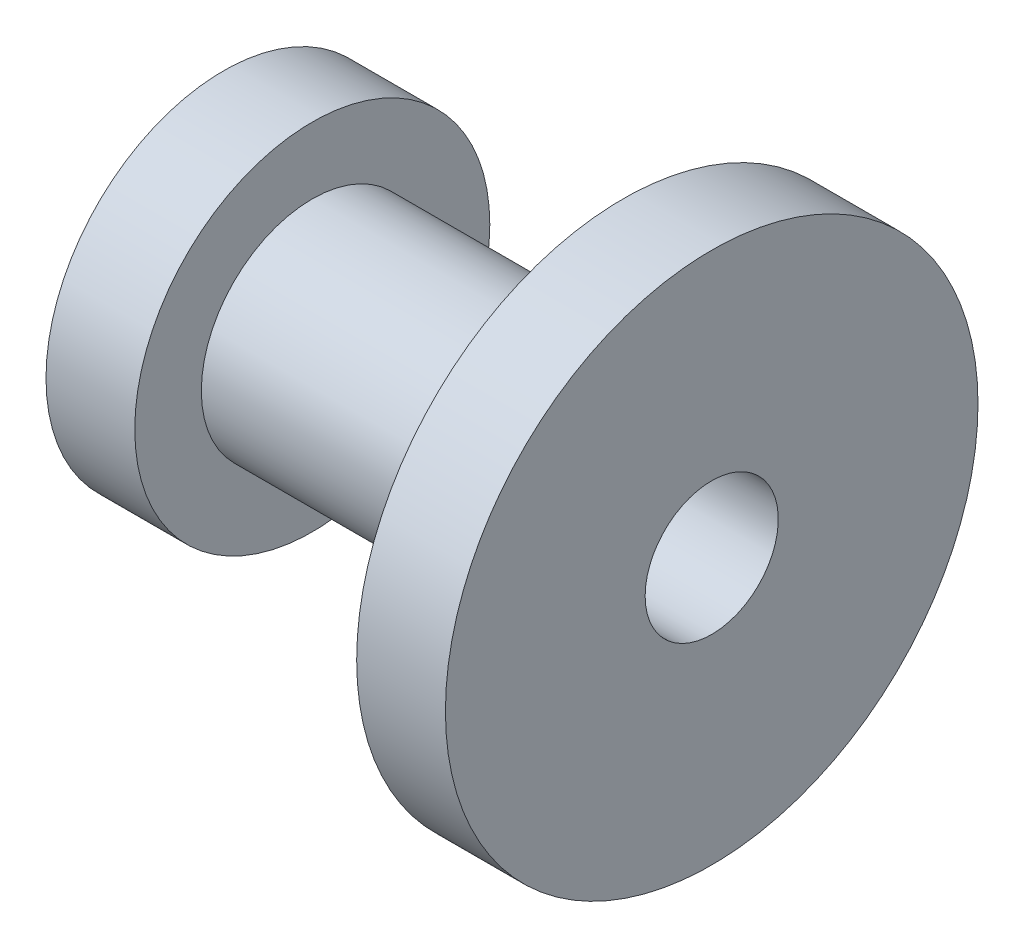
ISO-10303-21;
HEADER;
FILE_DESCRIPTION(('STEP AP214'),'2;1');
FILE_NAME('part.step','',(''),(''),'','','');
FILE_SCHEMA(('AUTOMOTIVE_DESIGN { 1 0 10303 214 1 1 1 1 }'));
ENDSEC;
DATA;
#1=APPLICATION_CONTEXT('core data for automotive mechanical design processes');
#2=APPLICATION_PROTOCOL_DEFINITION('international standard','automotive_design',2000,#1);
#3=PRODUCT_CONTEXT('',#1,'mechanical');
#4=PRODUCT('Part','Part','',(#3));
#5=PRODUCT_RELATED_PRODUCT_CATEGORY('part','',(#4));
#6=PRODUCT_DEFINITION_FORMATION('','',#4);
#7=PRODUCT_DEFINITION_CONTEXT('part definition',#1,'design');
#8=PRODUCT_DEFINITION('design','',#6,#7);
#9=PRODUCT_DEFINITION_SHAPE('','',#8);
#10=(LENGTH_UNIT() NAMED_UNIT(*) SI_UNIT(.MILLI.,.METRE.));
#11=(NAMED_UNIT(*) PLANE_ANGLE_UNIT() SI_UNIT($,.RADIAN.));
#12=(NAMED_UNIT(*) SI_UNIT($,.STERADIAN.) SOLID_ANGLE_UNIT());
#13=UNCERTAINTY_MEASURE_WITH_UNIT(LENGTH_MEASURE(1.E-05),#10,'distance_accuracy_value','');
#14=(GEOMETRIC_REPRESENTATION_CONTEXT(3) GLOBAL_UNCERTAINTY_ASSIGNED_CONTEXT((#13)) GLOBAL_UNIT_ASSIGNED_CONTEXT((#10,
#11,#12)) REPRESENTATION_CONTEXT('',''));
#15=CARTESIAN_POINT('',(0.,0.,0.));
#16=DIRECTION('',(0.,0.,1.));
#17=DIRECTION('',(1.,0.,0.));
#18=AXIS2_PLACEMENT_3D('',#15,#16,#17);
#19=CARTESIAN_POINT('',(0.,0.,0.));
#20=DIRECTION('',(1.,0.,0.));
#21=DIRECTION('',(0.,0.,-1.));
#22=AXIS2_PLACEMENT_3D('',#19,#20,#21);
#23=PLANE('',#22);
#24=CARTESIAN_POINT('',(0.,0.,0.));
#25=DIRECTION('',(-1.,0.,0.));
#26=DIRECTION('',(0.,0.,1.));
#27=AXIS2_PLACEMENT_3D('',#24,#25,#26);
#28=CIRCLE('',#27,15.);
#29=CARTESIAN_POINT('',(0.,0.,15.));
#30=VERTEX_POINT('',#29);
#31=EDGE_CURVE('E56',#30,#30,#28,.T.);
#32=ORIENTED_EDGE('',*,*,#31,.F.);
#33=EDGE_LOOP('',(#32));
#34=FACE_BOUND('',#33,.T.);
#35=CARTESIAN_POINT('',(0.,0.,0.));
#36=DIRECTION('',(-1.,0.,0.));
#37=DIRECTION('',(0.,0.,1.));
#38=AXIS2_PLACEMENT_3D('',#35,#36,#37);
#39=CIRCLE('',#38,40.);
#40=CARTESIAN_POINT('',(0.,0.,40.));
#41=VERTEX_POINT('',#40);
#42=EDGE_CURVE('E10',#41,#41,#39,.T.);
#43=ORIENTED_EDGE('',*,*,#42,.T.);
#44=EDGE_LOOP('',(#43));
#45=FACE_BOUND('',#44,.T.);
#46=ADVANCED_FACE('F31',(#34,#45),#23,.F.);
#47=CARTESIAN_POINT('',(0.,0.,0.));
#48=DIRECTION('',(-1.,0.,0.));
#49=DIRECTION('',(0.,0.,1.));
#50=AXIS2_PLACEMENT_3D('',#47,#48,#49);
#51=CYLINDRICAL_SURFACE('',#50,40.);
#52=ORIENTED_EDGE('',*,*,#42,.F.);
#53=EDGE_LOOP('',(#52));
#54=FACE_BOUND('',#53,.T.);
#55=CARTESIAN_POINT('',(20.,0.,0.));
#56=DIRECTION('',(-1.,0.,0.));
#57=DIRECTION('',(0.,0.,1.));
#58=AXIS2_PLACEMENT_3D('',#55,#56,#57);
#59=CIRCLE('',#58,40.);
#60=CARTESIAN_POINT('',(20.,0.,40.));
#61=VERTEX_POINT('',#60);
#62=EDGE_CURVE('E38',#61,#61,#59,.T.);
#63=ORIENTED_EDGE('',*,*,#62,.T.);
#64=EDGE_LOOP('',(#63));
#65=FACE_BOUND('',#64,.T.);
#66=ADVANCED_FACE('F75',(#54,#65),#51,.T.);
#67=CARTESIAN_POINT('',(20.,40.,0.));
#68=DIRECTION('',(-1.,0.,0.));
#69=DIRECTION('',(0.,0.,1.));
#70=AXIS2_PLACEMENT_3D('',#67,#68,#69);
#71=PLANE('',#70);
#72=ORIENTED_EDGE('',*,*,#62,.F.);
#73=EDGE_LOOP('',(#72));
#74=FACE_BOUND('',#73,.T.);
#75=CARTESIAN_POINT('',(20.,0.,0.));
#76=DIRECTION('',(-1.,0.,0.));
#77=DIRECTION('',(0.,0.,1.));
#78=AXIS2_PLACEMENT_3D('',#75,#76,#77);
#79=CIRCLE('',#78,25.);
#80=CARTESIAN_POINT('',(20.,0.,25.));
#81=VERTEX_POINT('',#80);
#82=EDGE_CURVE('E42',#81,#81,#79,.T.);
#83=ORIENTED_EDGE('',*,*,#82,.T.);
#84=EDGE_LOOP('',(#83));
#85=FACE_BOUND('',#84,.T.);
#86=ADVANCED_FACE('F80',(#74,#85),#71,.F.);
#87=CARTESIAN_POINT('',(0.,0.,0.));
#88=DIRECTION('',(-1.,0.,0.));
#89=DIRECTION('',(0.,0.,1.));
#90=AXIS2_PLACEMENT_3D('',#87,#88,#89);
#91=CYLINDRICAL_SURFACE('',#90,25.);
#92=ORIENTED_EDGE('',*,*,#82,.F.);
#93=EDGE_LOOP('',(#92));
#94=FACE_BOUND('',#93,.T.);
#95=CARTESIAN_POINT('',(90.,0.,0.));
#96=DIRECTION('',(-1.,0.,0.));
#97=DIRECTION('',(0.,0.,1.));
#98=AXIS2_PLACEMENT_3D('',#95,#96,#97);
#99=CIRCLE('',#98,25.);
#100=CARTESIAN_POINT('',(90.,0.,25.));
#101=VERTEX_POINT('',#100);
#102=EDGE_CURVE('E47',#101,#101,#99,.T.);
#103=ORIENTED_EDGE('',*,*,#102,.T.);
#104=EDGE_LOOP('',(#103));
#105=FACE_BOUND('',#104,.T.);
#106=ADVANCED_FACE('F85',(#94,#105),#91,.T.);
#107=CARTESIAN_POINT('',(90.,25.,0.));
#108=DIRECTION('',(1.,0.,0.));
#109=DIRECTION('',(0.,0.,-1.));
#110=AXIS2_PLACEMENT_3D('',#107,#108,#109);
#111=PLANE('',#110);
#112=ORIENTED_EDGE('',*,*,#102,.F.);
#113=EDGE_LOOP('',(#112));
#114=FACE_BOUND('',#113,.T.);
#115=CARTESIAN_POINT('',(90.,0.,0.));
#116=DIRECTION('',(-1.,0.,0.));
#117=DIRECTION('',(0.,0.,1.));
#118=AXIS2_PLACEMENT_3D('',#115,#116,#117);
#119=CIRCLE('',#118,60.);
#120=CARTESIAN_POINT('',(90.,0.,60.));
#121=VERTEX_POINT('',#120);
#122=EDGE_CURVE('E50',#121,#121,#119,.T.);
#123=ORIENTED_EDGE('',*,*,#122,.T.);
#124=EDGE_LOOP('',(#123));
#125=FACE_BOUND('',#124,.T.);
#126=ADVANCED_FACE('F92',(#114,#125),#111,.F.);
#127=CARTESIAN_POINT('',(0.,0.,0.));
#128=DIRECTION('',(-1.,0.,0.));
#129=DIRECTION('',(0.,0.,1.));
#130=AXIS2_PLACEMENT_3D('',#127,#128,#129);
#131=CYLINDRICAL_SURFACE('',#130,60.);
#132=ORIENTED_EDGE('',*,*,#122,.F.);
#133=EDGE_LOOP('',(#132));
#134=FACE_BOUND('',#133,.T.);
#135=CARTESIAN_POINT('',(110.,0.,0.));
#136=DIRECTION('',(-1.,0.,0.));
#137=DIRECTION('',(0.,0.,1.));
#138=AXIS2_PLACEMENT_3D('',#135,#136,#137);
#139=CIRCLE('',#138,60.);
#140=CARTESIAN_POINT('',(110.,0.,60.));
#141=VERTEX_POINT('',#140);
#142=EDGE_CURVE('E53',#141,#141,#139,.T.);
#143=ORIENTED_EDGE('',*,*,#142,.T.);
#144=EDGE_LOOP('',(#143));
#145=FACE_BOUND('',#144,.T.);
#146=ADVANCED_FACE('F72',(#134,#145),#131,.T.);
#147=CARTESIAN_POINT('',(110.,60.,0.));
#148=DIRECTION('',(-1.,0.,0.));
#149=DIRECTION('',(0.,0.,1.));
#150=AXIS2_PLACEMENT_3D('',#147,#148,#149);
#151=PLANE('',#150);
#152=CARTESIAN_POINT('',(110.,0.,0.));
#153=DIRECTION('',(-1.,0.,0.));
#154=DIRECTION('',(0.,0.,1.));
#155=AXIS2_PLACEMENT_3D('',#152,#153,#154);
#156=CIRCLE('',#155,15.);
#157=CARTESIAN_POINT('',(110.,0.,15.));
#158=VERTEX_POINT('',#157);
#159=EDGE_CURVE('E34',#158,#158,#156,.T.);
#160=ORIENTED_EDGE('',*,*,#159,.T.);
#161=EDGE_LOOP('',(#160));
#162=FACE_BOUND('',#161,.T.);
#163=ORIENTED_EDGE('',*,*,#142,.F.);
#164=EDGE_LOOP('',(#163));
#165=FACE_BOUND('',#164,.T.);
#166=ADVANCED_FACE('F63',(#162,#165),#151,.F.);
#167=CARTESIAN_POINT('',(227.,0.,0.));
#168=DIRECTION('',(-1.,0.,0.));
#169=DIRECTION('',(0.,0.,1.));
#170=AXIS2_PLACEMENT_3D('',#167,#168,#169);
#171=CYLINDRICAL_SURFACE('',#170,15.);
#172=ORIENTED_EDGE('',*,*,#31,.T.);
#173=EDGE_LOOP('',(#172));
#174=FACE_BOUND('',#173,.T.);
#175=ORIENTED_EDGE('',*,*,#159,.F.);
#176=EDGE_LOOP('',(#175));
#177=FACE_BOUND('',#176,.T.);
#178=ADVANCED_FACE('F66',(#174,#177),#171,.F.);
#179=CLOSED_SHELL('',(#46,#66,#86,#106,#126,#146,#166,#178));
#180=MANIFOLD_SOLID_BREP('B2',#179);
#181=ADVANCED_BREP_SHAPE_REPRESENTATION('',(#18,#180),#14);
#182=SHAPE_DEFINITION_REPRESENTATION(#9,#181);
ENDSEC;
END-ISO-10303-21;
